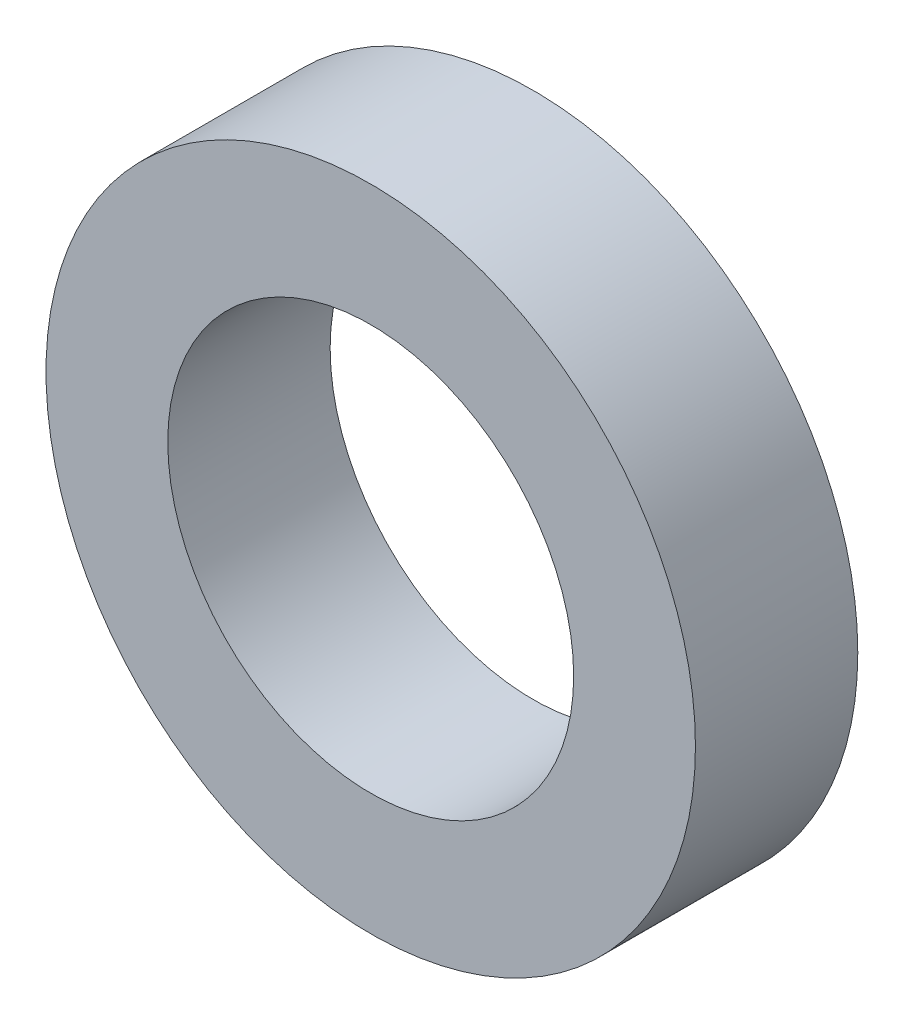
ISO-10303-21;
HEADER;
FILE_DESCRIPTION(('STEP AP214'),'2;1');
FILE_NAME('part.step','',(''),(''),'','','');
FILE_SCHEMA(('AUTOMOTIVE_DESIGN { 1 0 10303 214 1 1 1 1 }'));
ENDSEC;
DATA;
#1=APPLICATION_CONTEXT('core data for automotive mechanical design processes');
#2=APPLICATION_PROTOCOL_DEFINITION('international standard','automotive_design',2000,#1);
#3=PRODUCT_CONTEXT('',#1,'mechanical');
#4=PRODUCT('Part','Part','',(#3));
#5=PRODUCT_RELATED_PRODUCT_CATEGORY('part','',(#4));
#6=PRODUCT_DEFINITION_FORMATION('','',#4);
#7=PRODUCT_DEFINITION_CONTEXT('part definition',#1,'design');
#8=PRODUCT_DEFINITION('design','',#6,#7);
#9=PRODUCT_DEFINITION_SHAPE('','',#8);
#10=(LENGTH_UNIT() NAMED_UNIT(*) SI_UNIT(.MILLI.,.METRE.));
#11=(NAMED_UNIT(*) PLANE_ANGLE_UNIT() SI_UNIT($,.RADIAN.));
#12=(NAMED_UNIT(*) SI_UNIT($,.STERADIAN.) SOLID_ANGLE_UNIT());
#13=UNCERTAINTY_MEASURE_WITH_UNIT(LENGTH_MEASURE(1.E-05),#10,'distance_accuracy_value','');
#14=(GEOMETRIC_REPRESENTATION_CONTEXT(3) GLOBAL_UNCERTAINTY_ASSIGNED_CONTEXT((#13)) GLOBAL_UNIT_ASSIGNED_CONTEXT((#10,
#11,#12)) REPRESENTATION_CONTEXT('',''));
#15=CARTESIAN_POINT('',(0.,0.,0.));
#16=DIRECTION('',(0.,0.,1.));
#17=DIRECTION('',(1.,0.,0.));
#18=AXIS2_PLACEMENT_3D('',#15,#16,#17);
#19=CARTESIAN_POINT('',(0.,0.,2.));
#20=DIRECTION('',(0.,0.,1.));
#21=DIRECTION('',(1.,0.,0.));
#22=AXIS2_PLACEMENT_3D('',#19,#20,#21);
#23=PLANE('',#22);
#24=CARTESIAN_POINT('',(0.,0.,2.));
#25=DIRECTION('',(0.,0.,1.));
#26=DIRECTION('',(1.,0.,0.));
#27=AXIS2_PLACEMENT_3D('',#24,#25,#26);
#28=CIRCLE('',#27,4.);
#29=CARTESIAN_POINT('',(4.,0.,2.));
#30=VERTEX_POINT('',#29);
#31=EDGE_CURVE('E10',#30,#30,#28,.T.);
#32=ORIENTED_EDGE('',*,*,#31,.T.);
#33=EDGE_LOOP('',(#32));
#34=FACE_BOUND('',#33,.T.);
#35=CARTESIAN_POINT('',(0.,0.,2.));
#36=DIRECTION('',(0.,0.,1.));
#37=DIRECTION('',(1.,0.,0.));
#38=AXIS2_PLACEMENT_3D('',#35,#36,#37);
#39=CIRCLE('',#38,2.5);
#40=CARTESIAN_POINT('',(2.5,0.,2.));
#41=VERTEX_POINT('',#40);
#42=EDGE_CURVE('E56',#41,#41,#39,.T.);
#43=ORIENTED_EDGE('',*,*,#42,.F.);
#44=EDGE_LOOP('',(#43));
#45=FACE_BOUND('',#44,.T.);
#46=ADVANCED_FACE('F43',(#34,#45),#23,.T.);
#47=CARTESIAN_POINT('',(0.,0.,0.));
#48=DIRECTION('',(0.,0.,1.));
#49=DIRECTION('',(1.,0.,0.));
#50=AXIS2_PLACEMENT_3D('',#47,#48,#49);
#51=PLANE('',#50);
#52=CARTESIAN_POINT('',(0.,0.,0.));
#53=DIRECTION('',(0.,0.,1.));
#54=DIRECTION('',(1.,0.,0.));
#55=AXIS2_PLACEMENT_3D('',#52,#53,#54);
#56=CIRCLE('',#55,4.);
#57=CARTESIAN_POINT('',(4.,0.,0.));
#58=VERTEX_POINT('',#57);
#59=EDGE_CURVE('E47',#58,#58,#56,.T.);
#60=ORIENTED_EDGE('',*,*,#59,.F.);
#61=EDGE_LOOP('',(#60));
#62=FACE_BOUND('',#61,.T.);
#63=CARTESIAN_POINT('',(0.,0.,0.));
#64=DIRECTION('',(0.,0.,1.));
#65=DIRECTION('',(1.,0.,0.));
#66=AXIS2_PLACEMENT_3D('',#63,#64,#65);
#67=CIRCLE('',#66,2.5);
#68=CARTESIAN_POINT('',(2.5,0.,0.));
#69=VERTEX_POINT('',#68);
#70=EDGE_CURVE('E58',#69,#69,#67,.T.);
#71=ORIENTED_EDGE('',*,*,#70,.T.);
#72=EDGE_LOOP('',(#71));
#73=FACE_BOUND('',#72,.T.);
#74=ADVANCED_FACE('F70',(#62,#73),#51,.F.);
#75=CARTESIAN_POINT('',(0.,0.,2.));
#76=DIRECTION('',(0.,0.,-1.));
#77=DIRECTION('',(-1.,0.,0.));
#78=AXIS2_PLACEMENT_3D('',#75,#76,#77);
#79=CYLINDRICAL_SURFACE('',#78,4.);
#80=ORIENTED_EDGE('',*,*,#31,.F.);
#81=EDGE_LOOP('',(#80));
#82=FACE_BOUND('',#81,.T.);
#83=ORIENTED_EDGE('',*,*,#59,.T.);
#84=EDGE_LOOP('',(#83));
#85=FACE_BOUND('',#84,.T.);
#86=ADVANCED_FACE('F45',(#82,#85),#79,.T.);
#87=CARTESIAN_POINT('',(0.,0.,2.));
#88=DIRECTION('',(0.,0.,-1.));
#89=DIRECTION('',(-1.,0.,0.));
#90=AXIS2_PLACEMENT_3D('',#87,#88,#89);
#91=CYLINDRICAL_SURFACE('',#90,2.5);
#92=ORIENTED_EDGE('',*,*,#42,.T.);
#93=EDGE_LOOP('',(#92));
#94=FACE_BOUND('',#93,.T.);
#95=ORIENTED_EDGE('',*,*,#70,.F.);
#96=EDGE_LOOP('',(#95));
#97=FACE_BOUND('',#96,.T.);
#98=ADVANCED_FACE('F66',(#94,#97),#91,.F.);
#99=CLOSED_SHELL('',(#46,#74,#86,#98));
#100=MANIFOLD_SOLID_BREP('B2',#99);
#101=ADVANCED_BREP_SHAPE_REPRESENTATION('',(#18,#100),#14);
#102=SHAPE_DEFINITION_REPRESENTATION(#9,#101);
ENDSEC;
END-ISO-10303-21;
